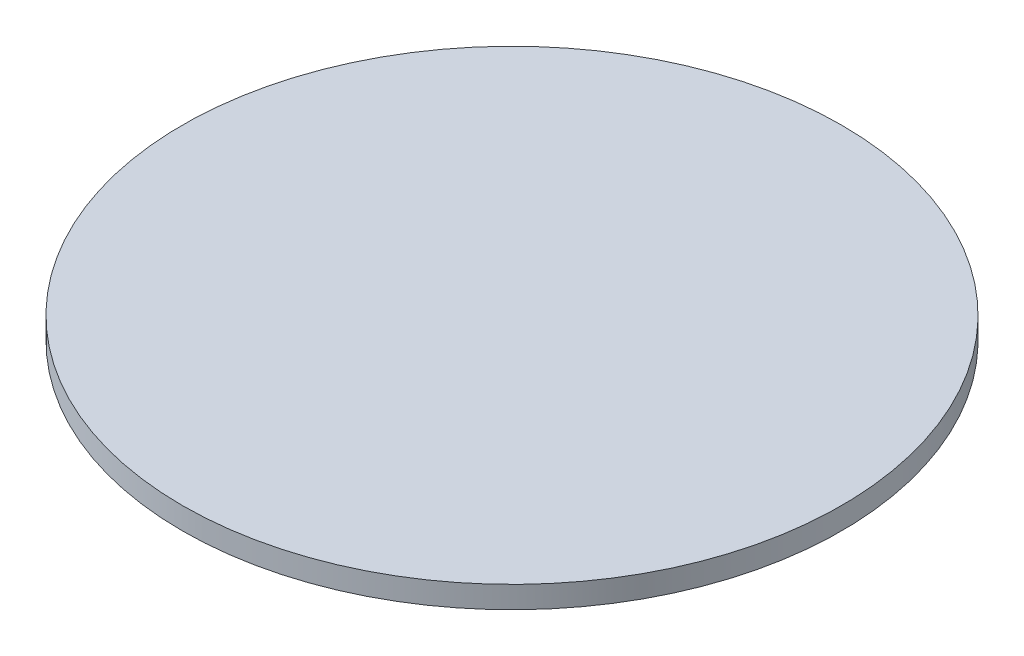
ISO-10303-21;
HEADER;
FILE_DESCRIPTION(('STEP AP214'),'2;1');
FILE_NAME('part.step','',(''),(''),'','','');
FILE_SCHEMA(('AUTOMOTIVE_DESIGN { 1 0 10303 214 1 1 1 1 }'));
ENDSEC;
DATA;
#1=APPLICATION_CONTEXT('core data for automotive mechanical design processes');
#2=APPLICATION_PROTOCOL_DEFINITION('international standard','automotive_design',2000,#1);
#3=PRODUCT_CONTEXT('',#1,'mechanical');
#4=PRODUCT('Part','Part','',(#3));
#5=PRODUCT_RELATED_PRODUCT_CATEGORY('part','',(#4));
#6=PRODUCT_DEFINITION_FORMATION('','',#4);
#7=PRODUCT_DEFINITION_CONTEXT('part definition',#1,'design');
#8=PRODUCT_DEFINITION('design','',#6,#7);
#9=PRODUCT_DEFINITION_SHAPE('','',#8);
#10=(LENGTH_UNIT() NAMED_UNIT(*) SI_UNIT(.MILLI.,.METRE.));
#11=(NAMED_UNIT(*) PLANE_ANGLE_UNIT() SI_UNIT($,.RADIAN.));
#12=(NAMED_UNIT(*) SI_UNIT($,.STERADIAN.) SOLID_ANGLE_UNIT());
#13=UNCERTAINTY_MEASURE_WITH_UNIT(LENGTH_MEASURE(1.E-05),#10,'distance_accuracy_value','');
#14=(GEOMETRIC_REPRESENTATION_CONTEXT(3) GLOBAL_UNCERTAINTY_ASSIGNED_CONTEXT((#13)) GLOBAL_UNIT_ASSIGNED_CONTEXT((#10,
#11,#12)) REPRESENTATION_CONTEXT('',''));
#15=CARTESIAN_POINT('',(0.,0.,0.));
#16=DIRECTION('',(0.,0.,1.));
#17=DIRECTION('',(1.,0.,0.));
#18=AXIS2_PLACEMENT_3D('',#15,#16,#17);
#19=CARTESIAN_POINT('',(0.,2.54,0.));
#20=DIRECTION('',(0.,-1.,0.));
#21=DIRECTION('',(0.,0.,-1.));
#22=AXIS2_PLACEMENT_3D('',#19,#20,#21);
#23=CYLINDRICAL_SURFACE('',#22,38.1);
#24=CARTESIAN_POINT('',(0.,2.54,0.));
#25=DIRECTION('',(0.,1.,0.));
#26=DIRECTION('',(0.,0.,1.));
#27=AXIS2_PLACEMENT_3D('',#24,#25,#26);
#28=CIRCLE('',#27,38.1);
#29=CARTESIAN_POINT('',(0.,2.54,38.1));
#30=VERTEX_POINT('',#29);
#31=EDGE_CURVE('E10',#30,#30,#28,.T.);
#32=ORIENTED_EDGE('',*,*,#31,.F.);
#33=EDGE_LOOP('',(#32));
#34=FACE_BOUND('',#33,.T.);
#35=CARTESIAN_POINT('',(0.,0.,0.));
#36=DIRECTION('',(0.,1.,0.));
#37=DIRECTION('',(0.,0.,1.));
#38=AXIS2_PLACEMENT_3D('',#35,#36,#37);
#39=CIRCLE('',#38,38.1);
#40=CARTESIAN_POINT('',(0.,0.,38.1));
#41=VERTEX_POINT('',#40);
#42=EDGE_CURVE('E44',#41,#41,#39,.T.);
#43=ORIENTED_EDGE('',*,*,#42,.T.);
#44=EDGE_LOOP('',(#43));
#45=FACE_BOUND('',#44,.T.);
#46=ADVANCED_FACE('F41',(#34,#45),#23,.T.);
#47=CARTESIAN_POINT('',(0.,2.54,0.));
#48=DIRECTION('',(0.,1.,0.));
#49=DIRECTION('',(0.,0.,1.));
#50=AXIS2_PLACEMENT_3D('',#47,#48,#49);
#51=PLANE('',#50);
#52=ORIENTED_EDGE('',*,*,#31,.T.);
#53=EDGE_LOOP('',(#52));
#54=FACE_BOUND('',#53,.T.);
#55=ADVANCED_FACE('F58',(#54),#51,.T.);
#56=CARTESIAN_POINT('',(0.,0.,0.));
#57=DIRECTION('',(0.,1.,0.));
#58=DIRECTION('',(0.,0.,1.));
#59=AXIS2_PLACEMENT_3D('',#56,#57,#58);
#60=PLANE('',#59);
#61=ORIENTED_EDGE('',*,*,#42,.F.);
#62=EDGE_LOOP('',(#61));
#63=FACE_BOUND('',#62,.T.);
#64=ADVANCED_FACE('F56',(#63),#60,.F.);
#65=CLOSED_SHELL('',(#46,#55,#64));
#66=MANIFOLD_SOLID_BREP('B2',#65);
#67=ADVANCED_BREP_SHAPE_REPRESENTATION('',(#18,#66),#14);
#68=SHAPE_DEFINITION_REPRESENTATION(#9,#67);
ENDSEC;
END-ISO-10303-21;
